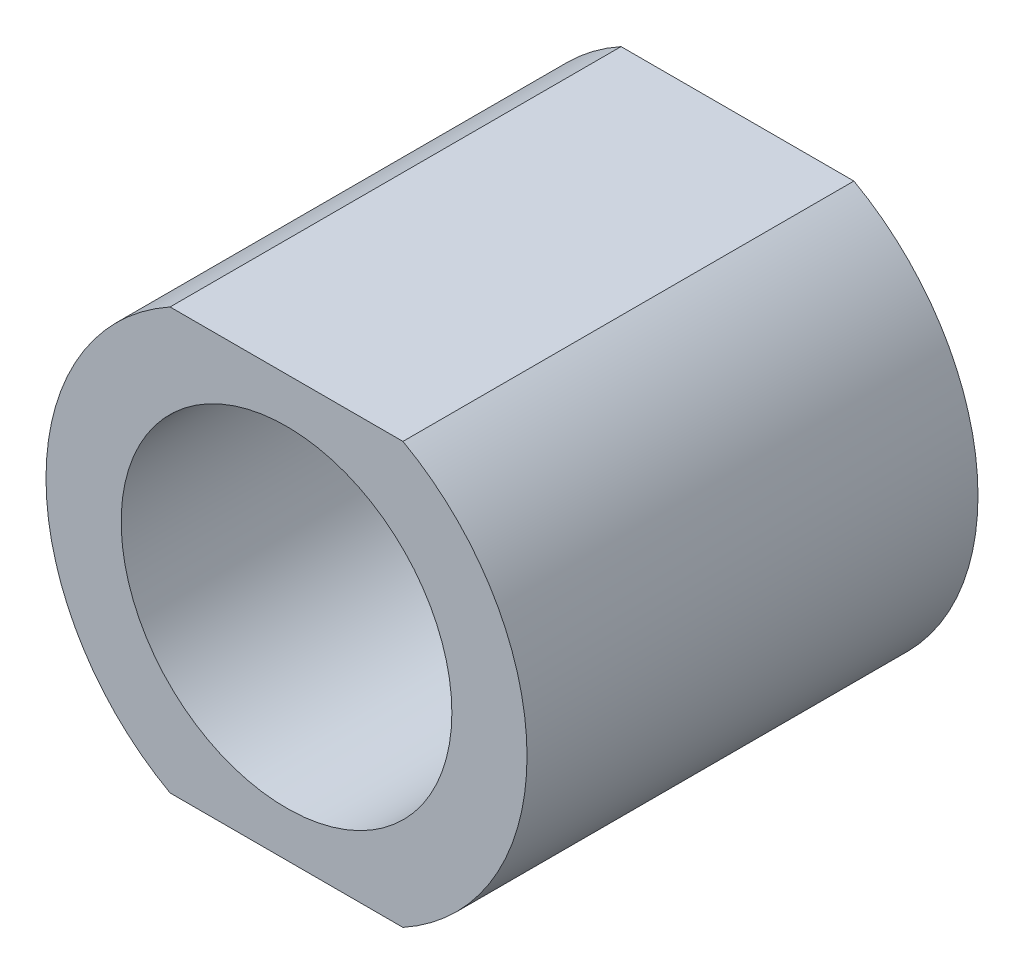
ISO-10303-21;
HEADER;
FILE_DESCRIPTION(('STEP AP214'),'2;1');
FILE_NAME('part.step','',(''),(''),'','','');
FILE_SCHEMA(('AUTOMOTIVE_DESIGN { 1 0 10303 214 1 1 1 1 }'));
ENDSEC;
DATA;
#1=APPLICATION_CONTEXT('core data for automotive mechanical design processes');
#2=APPLICATION_PROTOCOL_DEFINITION('international standard','automotive_design',2000,#1);
#3=PRODUCT_CONTEXT('',#1,'mechanical');
#4=PRODUCT('Part','Part','',(#3));
#5=PRODUCT_RELATED_PRODUCT_CATEGORY('part','',(#4));
#6=PRODUCT_DEFINITION_FORMATION('','',#4);
#7=PRODUCT_DEFINITION_CONTEXT('part definition',#1,'design');
#8=PRODUCT_DEFINITION('design','',#6,#7);
#9=PRODUCT_DEFINITION_SHAPE('','',#8);
#10=(LENGTH_UNIT() NAMED_UNIT(*) SI_UNIT(.MILLI.,.METRE.));
#11=(NAMED_UNIT(*) PLANE_ANGLE_UNIT() SI_UNIT($,.RADIAN.));
#12=(NAMED_UNIT(*) SI_UNIT($,.STERADIAN.) SOLID_ANGLE_UNIT());
#13=UNCERTAINTY_MEASURE_WITH_UNIT(LENGTH_MEASURE(1.E-05),#10,'distance_accuracy_value','');
#14=(GEOMETRIC_REPRESENTATION_CONTEXT(3) GLOBAL_UNCERTAINTY_ASSIGNED_CONTEXT((#13)) GLOBAL_UNIT_ASSIGNED_CONTEXT((#10,
#11,#12)) REPRESENTATION_CONTEXT('',''));
#15=CARTESIAN_POINT('',(0.,0.,0.));
#16=DIRECTION('',(0.,0.,1.));
#17=DIRECTION('',(1.,0.,0.));
#18=AXIS2_PLACEMENT_3D('',#15,#16,#17);
#19=CARTESIAN_POINT('',(0.,0.,30.));
#20=DIRECTION('',(0.,0.,-1.));
#21=DIRECTION('',(-1.,0.,0.));
#22=AXIS2_PLACEMENT_3D('',#19,#20,#21);
#23=CYLINDRICAL_SURFACE('',#22,16.);
#24=CARTESIAN_POINT('',(0.,0.,30.));
#25=DIRECTION('',(0.,0.,1.));
#26=DIRECTION('',(1.,0.,0.));
#27=AXIS2_PLACEMENT_3D('',#24,#25,#26);
#28=CIRCLE('',#27,16.);
#29=CARTESIAN_POINT('',(7.74596669241483,-14.,30.));
#30=VERTEX_POINT('',#29);
#31=CARTESIAN_POINT('',(7.74596669241482,14.,30.));
#32=VERTEX_POINT('',#31);
#33=EDGE_CURVE('E53',#30,#32,#28,.T.);
#34=ORIENTED_EDGE('',*,*,#33,.F.);
#35=DIRECTION('',(0.,0.,-1.));
#36=VECTOR('',#35,1.);
#37=CARTESIAN_POINT('',(7.74596669241483,-14.,30.));
#38=LINE('',#37,#36);
#39=CARTESIAN_POINT('',(7.74596669241483,-14.,0.));
#40=VERTEX_POINT('',#39);
#41=EDGE_CURVE('E11',#30,#40,#38,.T.);
#42=ORIENTED_EDGE('',*,*,#41,.T.);
#43=CARTESIAN_POINT('',(0.,0.,0.));
#44=DIRECTION('',(0.,0.,1.));
#45=DIRECTION('',(1.,0.,0.));
#46=AXIS2_PLACEMENT_3D('',#43,#44,#45);
#47=CIRCLE('',#46,16.);
#48=CARTESIAN_POINT('',(7.74596669241482,14.,0.));
#49=VERTEX_POINT('',#48);
#50=EDGE_CURVE('E87',#40,#49,#47,.T.);
#51=ORIENTED_EDGE('',*,*,#50,.T.);
#52=DIRECTION('',(0.,0.,-1.));
#53=VECTOR('',#52,1.);
#54=CARTESIAN_POINT('',(7.74596669241482,14.,30.));
#55=LINE('',#54,#53);
#56=EDGE_CURVE('E83',#49,#32,#55,.F.);
#57=ORIENTED_EDGE('',*,*,#56,.T.);
#58=EDGE_LOOP('',(#34,#42,#51,#57));
#59=FACE_BOUND('',#58,.T.);
#60=ADVANCED_FACE('F31',(#59),#23,.T.);
#61=CARTESIAN_POINT('',(0.,0.,30.));
#62=DIRECTION('',(0.,0.,1.));
#63=DIRECTION('',(1.,0.,0.));
#64=AXIS2_PLACEMENT_3D('',#61,#62,#63);
#65=PLANE('',#64);
#66=DIRECTION('',(-1.,0.,0.));
#67=VECTOR('',#66,1.);
#68=CARTESIAN_POINT('',(-18.8635341061283,-14.,30.));
#69=LINE('',#68,#67);
#70=CARTESIAN_POINT('',(-7.74596669241483,-14.,30.));
#71=VERTEX_POINT('',#70);
#72=EDGE_CURVE('E46',#30,#71,#69,.T.);
#73=ORIENTED_EDGE('',*,*,#72,.F.);
#74=ORIENTED_EDGE('',*,*,#33,.T.);
#75=DIRECTION('',(1.,0.,0.));
#76=VECTOR('',#75,1.);
#77=CARTESIAN_POINT('',(-17.79445435215,14.,30.));
#78=LINE('',#77,#76);
#79=CARTESIAN_POINT('',(-7.74596669241483,14.,30.));
#80=VERTEX_POINT('',#79);
#81=EDGE_CURVE('E102',#80,#32,#78,.T.);
#82=ORIENTED_EDGE('',*,*,#81,.F.);
#83=EDGE_CURVE('E79',#80,#71,#28,.T.);
#84=ORIENTED_EDGE('',*,*,#83,.T.);
#85=EDGE_LOOP('',(#73,#74,#82,#84));
#86=FACE_BOUND('',#85,.T.);
#87=CARTESIAN_POINT('',(0.,0.,30.));
#88=DIRECTION('',(0.,0.,1.));
#89=DIRECTION('',(1.,0.,0.));
#90=AXIS2_PLACEMENT_3D('',#87,#88,#89);
#91=CIRCLE('',#90,11.);
#92=CARTESIAN_POINT('',(11.,0.,30.));
#93=VERTEX_POINT('',#92);
#94=EDGE_CURVE('E107',#93,#93,#91,.T.);
#95=ORIENTED_EDGE('',*,*,#94,.F.);
#96=EDGE_LOOP('',(#95));
#97=FACE_BOUND('',#96,.T.);
#98=ADVANCED_FACE('F76',(#86,#97),#65,.T.);
#99=CARTESIAN_POINT('',(0.,0.,0.));
#100=DIRECTION('',(0.,0.,1.));
#101=DIRECTION('',(1.,0.,0.));
#102=AXIS2_PLACEMENT_3D('',#99,#100,#101);
#103=PLANE('',#102);
#104=ORIENTED_EDGE('',*,*,#50,.F.);
#105=DIRECTION('',(-1.,0.,0.));
#106=VECTOR('',#105,1.);
#107=CARTESIAN_POINT('',(-18.8635341061283,-14.,0.));
#108=LINE('',#107,#106);
#109=CARTESIAN_POINT('',(-7.74596669241483,-14.,0.));
#110=VERTEX_POINT('',#109);
#111=EDGE_CURVE('E72',#40,#110,#108,.T.);
#112=ORIENTED_EDGE('',*,*,#111,.T.);
#113=CARTESIAN_POINT('',(-7.74596669241483,14.,0.));
#114=VERTEX_POINT('',#113);
#115=EDGE_CURVE('E84',#114,#110,#47,.T.);
#116=ORIENTED_EDGE('',*,*,#115,.F.);
#117=DIRECTION('',(1.,0.,0.));
#118=VECTOR('',#117,1.);
#119=CARTESIAN_POINT('',(-17.79445435215,14.,0.));
#120=LINE('',#119,#118);
#121=EDGE_CURVE('E104',#114,#49,#120,.T.);
#122=ORIENTED_EDGE('',*,*,#121,.T.);
#123=EDGE_LOOP('',(#104,#112,#116,#122));
#124=FACE_BOUND('',#123,.T.);
#125=CARTESIAN_POINT('',(0.,0.,0.));
#126=DIRECTION('',(0.,0.,1.));
#127=DIRECTION('',(1.,0.,0.));
#128=AXIS2_PLACEMENT_3D('',#125,#126,#127);
#129=CIRCLE('',#128,11.);
#130=CARTESIAN_POINT('',(11.,0.,0.));
#131=VERTEX_POINT('',#130);
#132=EDGE_CURVE('E90',#131,#131,#129,.T.);
#133=ORIENTED_EDGE('',*,*,#132,.T.);
#134=EDGE_LOOP('',(#133));
#135=FACE_BOUND('',#134,.T.);
#136=ADVANCED_FACE('F99',(#124,#135),#103,.F.);
#137=ORIENTED_EDGE('',*,*,#115,.T.);
#138=DIRECTION('',(0.,0.,-1.));
#139=VECTOR('',#138,1.);
#140=CARTESIAN_POINT('',(-7.74596669241483,-14.,30.));
#141=LINE('',#140,#139);
#142=EDGE_CURVE('E39',#110,#71,#141,.F.);
#143=ORIENTED_EDGE('',*,*,#142,.T.);
#144=ORIENTED_EDGE('',*,*,#83,.F.);
#145=DIRECTION('',(0.,0.,-1.));
#146=VECTOR('',#145,1.);
#147=CARTESIAN_POINT('',(-7.74596669241483,14.,30.));
#148=LINE('',#147,#146);
#149=EDGE_CURVE('E94',#80,#114,#148,.T.);
#150=ORIENTED_EDGE('',*,*,#149,.T.);
#151=EDGE_LOOP('',(#137,#143,#144,#150));
#152=FACE_BOUND('',#151,.T.);
#153=ADVANCED_FACE('F33',(#152),#23,.T.);
#154=CARTESIAN_POINT('',(0.,0.,30.));
#155=DIRECTION('',(0.,0.,-1.));
#156=DIRECTION('',(-1.,0.,0.));
#157=AXIS2_PLACEMENT_3D('',#154,#155,#156);
#158=CYLINDRICAL_SURFACE('',#157,11.);
#159=ORIENTED_EDGE('',*,*,#94,.T.);
#160=EDGE_LOOP('',(#159));
#161=FACE_BOUND('',#160,.T.);
#162=ORIENTED_EDGE('',*,*,#132,.F.);
#163=EDGE_LOOP('',(#162));
#164=FACE_BOUND('',#163,.T.);
#165=ADVANCED_FACE('F114',(#161,#164),#158,.F.);
#166=CARTESIAN_POINT('',(-17.79445435215,14.,0.));
#167=DIRECTION('',(0.,-1.,0.));
#168=DIRECTION('',(1.,0.,0.));
#169=AXIS2_PLACEMENT_3D('',#166,#167,#168);
#170=PLANE('',#169);
#171=ORIENTED_EDGE('',*,*,#81,.T.);
#172=ORIENTED_EDGE('',*,*,#56,.F.);
#173=ORIENTED_EDGE('',*,*,#121,.F.);
#174=ORIENTED_EDGE('',*,*,#149,.F.);
#175=EDGE_LOOP('',(#171,#172,#173,#174));
#176=FACE_BOUND('',#175,.T.);
#177=ADVANCED_FACE('F116',(#176),#170,.F.);
#178=CARTESIAN_POINT('',(-18.8635341061283,-14.,0.));
#179=DIRECTION('',(0.,1.,0.));
#180=DIRECTION('',(0.,0.,1.));
#181=AXIS2_PLACEMENT_3D('',#178,#179,#180);
#182=PLANE('',#181);
#183=ORIENTED_EDGE('',*,*,#72,.T.);
#184=ORIENTED_EDGE('',*,*,#142,.F.);
#185=ORIENTED_EDGE('',*,*,#111,.F.);
#186=ORIENTED_EDGE('',*,*,#41,.F.);
#187=EDGE_LOOP('',(#183,#184,#185,#186));
#188=FACE_BOUND('',#187,.T.);
#189=ADVANCED_FACE('F70',(#188),#182,.F.);
#190=CLOSED_SHELL('',(#60,#98,#136,#153,#165,#177,#189));
#191=MANIFOLD_SOLID_BREP('B2',#190);
#192=ADVANCED_BREP_SHAPE_REPRESENTATION('',(#18,#191),#14);
#193=SHAPE_DEFINITION_REPRESENTATION(#9,#192);
ENDSEC;
END-ISO-10303-21;
